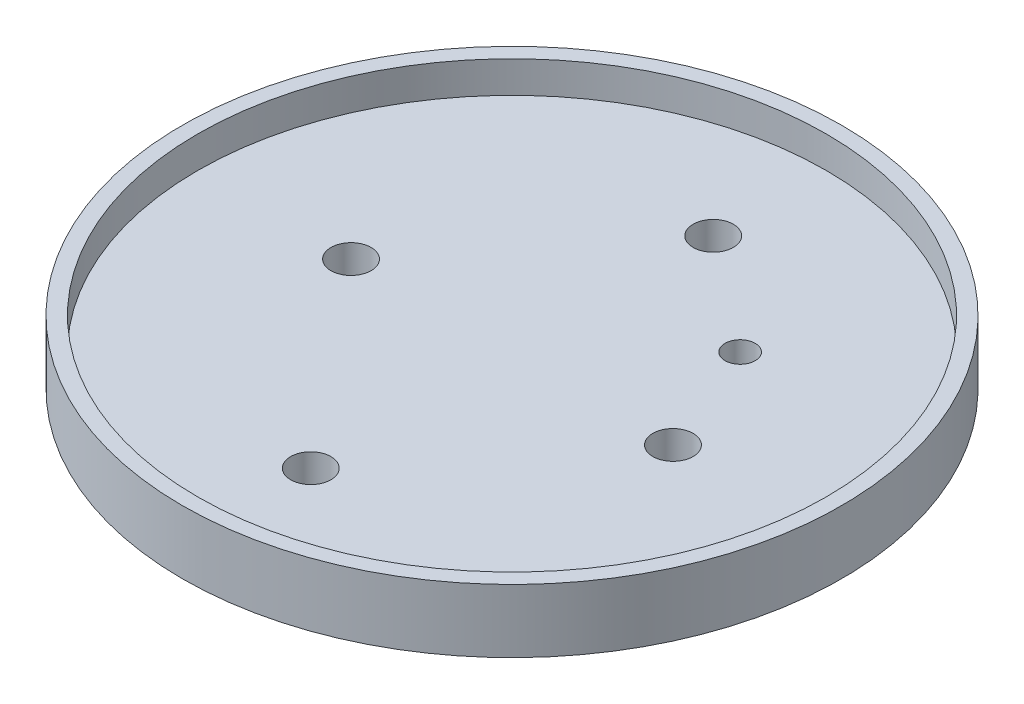
ISO-10303-21;
HEADER;
FILE_DESCRIPTION(('STEP AP214'),'2;1');
FILE_NAME('part.step','',(''),(''),'','','');
FILE_SCHEMA(('AUTOMOTIVE_DESIGN { 1 0 10303 214 1 1 1 1 }'));
ENDSEC;
DATA;
#1=APPLICATION_CONTEXT('core data for automotive mechanical design processes');
#2=APPLICATION_PROTOCOL_DEFINITION('international standard','automotive_design',2000,#1);
#3=PRODUCT_CONTEXT('',#1,'mechanical');
#4=PRODUCT('Part','Part','',(#3));
#5=PRODUCT_RELATED_PRODUCT_CATEGORY('part','',(#4));
#6=PRODUCT_DEFINITION_FORMATION('','',#4);
#7=PRODUCT_DEFINITION_CONTEXT('part definition',#1,'design');
#8=PRODUCT_DEFINITION('design','',#6,#7);
#9=PRODUCT_DEFINITION_SHAPE('','',#8);
#10=(LENGTH_UNIT() NAMED_UNIT(*) SI_UNIT(.MILLI.,.METRE.));
#11=(NAMED_UNIT(*) PLANE_ANGLE_UNIT() SI_UNIT($,.RADIAN.));
#12=(NAMED_UNIT(*) SI_UNIT($,.STERADIAN.) SOLID_ANGLE_UNIT());
#13=UNCERTAINTY_MEASURE_WITH_UNIT(LENGTH_MEASURE(1.E-05),#10,'distance_accuracy_value','');
#14=(GEOMETRIC_REPRESENTATION_CONTEXT(3) GLOBAL_UNCERTAINTY_ASSIGNED_CONTEXT((#13)) GLOBAL_UNIT_ASSIGNED_CONTEXT((#10,
#11,#12)) REPRESENTATION_CONTEXT('',''));
#15=CARTESIAN_POINT('',(0.,0.,0.));
#16=DIRECTION('',(0.,0.,1.));
#17=DIRECTION('',(1.,0.,0.));
#18=AXIS2_PLACEMENT_3D('',#15,#16,#17);
#19=CARTESIAN_POINT('',(0.,5.,0.));
#20=DIRECTION('',(0.,1.,0.));
#21=DIRECTION('',(0.,0.,1.));
#22=AXIS2_PLACEMENT_3D('',#19,#20,#21);
#23=PLANE('',#22);
#24=CARTESIAN_POINT('',(18.,5.,-18.));
#25=DIRECTION('',(0.,1.,0.));
#26=DIRECTION('',(0.,0.,1.));
#27=AXIS2_PLACEMENT_3D('',#24,#25,#26);
#28=CIRCLE('',#27,2.38);
#29=CARTESIAN_POINT('',(18.,5.,-15.62));
#30=VERTEX_POINT('',#29);
#31=EDGE_CURVE('E68',#30,#30,#28,.T.);
#32=ORIENTED_EDGE('',*,*,#31,.F.);
#33=EDGE_LOOP('',(#32));
#34=FACE_BOUND('',#33,.T.);
#35=CARTESIAN_POINT('',(-25.4,5.,0.));
#36=DIRECTION('',(0.,1.,0.));
#37=DIRECTION('',(0.,0.,1.));
#38=AXIS2_PLACEMENT_3D('',#35,#36,#37);
#39=CIRCLE('',#38,3.175);
#40=CARTESIAN_POINT('',(-25.4,5.,3.175));
#41=VERTEX_POINT('',#40);
#42=EDGE_CURVE('E56',#41,#41,#39,.T.);
#43=ORIENTED_EDGE('',*,*,#42,.F.);
#44=EDGE_LOOP('',(#43));
#45=FACE_BOUND('',#44,.T.);
#46=CARTESIAN_POINT('',(25.4,5.,0.));
#47=DIRECTION('',(0.,1.,0.));
#48=DIRECTION('',(0.,0.,1.));
#49=AXIS2_PLACEMENT_3D('',#46,#47,#48);
#50=CIRCLE('',#49,3.175);
#51=CARTESIAN_POINT('',(25.4,5.,3.175));
#52=VERTEX_POINT('',#51);
#53=EDGE_CURVE('E43',#52,#52,#50,.T.);
#54=ORIENTED_EDGE('',*,*,#53,.F.);
#55=EDGE_LOOP('',(#54));
#56=FACE_BOUND('',#55,.T.);
#57=CARTESIAN_POINT('',(0.,5.,-31.75));
#58=DIRECTION('',(0.,1.,0.));
#59=DIRECTION('',(0.,0.,1.));
#60=AXIS2_PLACEMENT_3D('',#57,#58,#59);
#61=CIRCLE('',#60,3.175);
#62=CARTESIAN_POINT('',(0.,5.,-28.575));
#63=VERTEX_POINT('',#62);
#64=EDGE_CURVE('E51',#63,#63,#61,.T.);
#65=ORIENTED_EDGE('',*,*,#64,.F.);
#66=EDGE_LOOP('',(#65));
#67=FACE_BOUND('',#66,.T.);
#68=CARTESIAN_POINT('',(0.,5.,31.75));
#69=DIRECTION('',(0.,1.,0.));
#70=DIRECTION('',(0.,0.,1.));
#71=AXIS2_PLACEMENT_3D('',#68,#69,#70);
#72=CIRCLE('',#71,3.175);
#73=CARTESIAN_POINT('',(0.,5.,34.925));
#74=VERTEX_POINT('',#73);
#75=EDGE_CURVE('E62',#74,#74,#72,.T.);
#76=ORIENTED_EDGE('',*,*,#75,.F.);
#77=EDGE_LOOP('',(#76));
#78=FACE_BOUND('',#77,.T.);
#79=CARTESIAN_POINT('',(0.,5.,0.));
#80=DIRECTION('',(0.,1.,0.));
#81=DIRECTION('',(0.,0.,1.));
#82=AXIS2_PLACEMENT_3D('',#79,#80,#81);
#83=CIRCLE('',#82,49.6);
#84=CARTESIAN_POINT('',(0.,5.,49.6));
#85=VERTEX_POINT('',#84);
#86=EDGE_CURVE('E10',#85,#85,#83,.F.);
#87=ORIENTED_EDGE('',*,*,#86,.F.);
#88=EDGE_LOOP('',(#87));
#89=FACE_BOUND('',#88,.T.);
#90=ADVANCED_FACE('F32',(#34,#45,#56,#67,#78,#89),#23,.T.);
#91=CARTESIAN_POINT('',(0.,0.,0.));
#92=DIRECTION('',(0.,1.,0.));
#93=DIRECTION('',(0.,0.,1.));
#94=AXIS2_PLACEMENT_3D('',#91,#92,#93);
#95=PLANE('',#94);
#96=CARTESIAN_POINT('',(0.,0.,0.));
#97=DIRECTION('',(0.,1.,0.));
#98=DIRECTION('',(0.,0.,1.));
#99=AXIS2_PLACEMENT_3D('',#96,#97,#98);
#100=CIRCLE('',#99,52.);
#101=CARTESIAN_POINT('',(0.,0.,52.));
#102=VERTEX_POINT('',#101);
#103=EDGE_CURVE('E39',#102,#102,#100,.T.);
#104=ORIENTED_EDGE('',*,*,#103,.F.);
#105=EDGE_LOOP('',(#104));
#106=FACE_BOUND('',#105,.T.);
#107=CARTESIAN_POINT('',(25.4,0.,0.));
#108=DIRECTION('',(0.,1.,0.));
#109=DIRECTION('',(0.,0.,1.));
#110=AXIS2_PLACEMENT_3D('',#107,#108,#109);
#111=CIRCLE('',#110,3.175);
#112=CARTESIAN_POINT('',(25.4,0.,3.175));
#113=VERTEX_POINT('',#112);
#114=EDGE_CURVE('E47',#113,#113,#111,.T.);
#115=ORIENTED_EDGE('',*,*,#114,.T.);
#116=EDGE_LOOP('',(#115));
#117=FACE_BOUND('',#116,.T.);
#118=CARTESIAN_POINT('',(0.,0.,-31.75));
#119=DIRECTION('',(0.,1.,0.));
#120=DIRECTION('',(0.,0.,1.));
#121=AXIS2_PLACEMENT_3D('',#118,#119,#120);
#122=CIRCLE('',#121,3.175);
#123=CARTESIAN_POINT('',(0.,0.,-28.575));
#124=VERTEX_POINT('',#123);
#125=EDGE_CURVE('E53',#124,#124,#122,.T.);
#126=ORIENTED_EDGE('',*,*,#125,.T.);
#127=EDGE_LOOP('',(#126));
#128=FACE_BOUND('',#127,.T.);
#129=CARTESIAN_POINT('',(-25.4,0.,0.));
#130=DIRECTION('',(0.,1.,0.));
#131=DIRECTION('',(0.,0.,1.));
#132=AXIS2_PLACEMENT_3D('',#129,#130,#131);
#133=CIRCLE('',#132,3.175);
#134=CARTESIAN_POINT('',(-25.4,0.,3.175));
#135=VERTEX_POINT('',#134);
#136=EDGE_CURVE('E59',#135,#135,#133,.T.);
#137=ORIENTED_EDGE('',*,*,#136,.T.);
#138=EDGE_LOOP('',(#137));
#139=FACE_BOUND('',#138,.T.);
#140=CARTESIAN_POINT('',(0.,0.,31.75));
#141=DIRECTION('',(0.,1.,0.));
#142=DIRECTION('',(0.,0.,1.));
#143=AXIS2_PLACEMENT_3D('',#140,#141,#142);
#144=CIRCLE('',#143,3.175);
#145=CARTESIAN_POINT('',(0.,0.,34.925));
#146=VERTEX_POINT('',#145);
#147=EDGE_CURVE('E65',#146,#146,#144,.T.);
#148=ORIENTED_EDGE('',*,*,#147,.T.);
#149=EDGE_LOOP('',(#148));
#150=FACE_BOUND('',#149,.T.);
#151=CARTESIAN_POINT('',(18.,0.,-18.));
#152=DIRECTION('',(0.,1.,0.));
#153=DIRECTION('',(0.,0.,1.));
#154=AXIS2_PLACEMENT_3D('',#151,#152,#153);
#155=CIRCLE('',#154,2.38);
#156=CARTESIAN_POINT('',(18.,0.,-15.62));
#157=VERTEX_POINT('',#156);
#158=EDGE_CURVE('E71',#157,#157,#155,.T.);
#159=ORIENTED_EDGE('',*,*,#158,.T.);
#160=EDGE_LOOP('',(#159));
#161=FACE_BOUND('',#160,.T.);
#162=ADVANCED_FACE('F99',(#106,#117,#128,#139,#150,#161),#95,.F.);
#163=CARTESIAN_POINT('',(0.,5.,0.));
#164=DIRECTION('',(0.,-1.,0.));
#165=DIRECTION('',(0.,0.,-1.));
#166=AXIS2_PLACEMENT_3D('',#163,#164,#165);
#167=CYLINDRICAL_SURFACE('',#166,52.);
#168=ORIENTED_EDGE('',*,*,#103,.T.);
#169=EDGE_LOOP('',(#168));
#170=FACE_BOUND('',#169,.T.);
#171=CARTESIAN_POINT('',(0.,10.,0.));
#172=DIRECTION('',(0.,1.,0.));
#173=DIRECTION('',(0.,0.,1.));
#174=AXIS2_PLACEMENT_3D('',#171,#172,#173);
#175=CIRCLE('',#174,52.);
#176=CARTESIAN_POINT('',(0.,10.,52.));
#177=VERTEX_POINT('',#176);
#178=EDGE_CURVE('E74',#177,#177,#175,.T.);
#179=ORIENTED_EDGE('',*,*,#178,.F.);
#180=EDGE_LOOP('',(#179));
#181=FACE_BOUND('',#180,.T.);
#182=ADVANCED_FACE('F34',(#170,#181),#167,.T.);
#183=CARTESIAN_POINT('',(25.4,5.,0.));
#184=DIRECTION('',(0.,-1.,0.));
#185=DIRECTION('',(0.,0.,-1.));
#186=AXIS2_PLACEMENT_3D('',#183,#184,#185);
#187=CYLINDRICAL_SURFACE('',#186,3.175);
#188=ORIENTED_EDGE('',*,*,#53,.T.);
#189=EDGE_LOOP('',(#188));
#190=FACE_BOUND('',#189,.T.);
#191=ORIENTED_EDGE('',*,*,#114,.F.);
#192=EDGE_LOOP('',(#191));
#193=FACE_BOUND('',#192,.T.);
#194=ADVANCED_FACE('F109',(#190,#193),#187,.F.);
#195=CARTESIAN_POINT('',(0.,5.,-31.75));
#196=DIRECTION('',(0.,-1.,0.));
#197=DIRECTION('',(0.,0.,-1.));
#198=AXIS2_PLACEMENT_3D('',#195,#196,#197);
#199=CYLINDRICAL_SURFACE('',#198,3.175);
#200=ORIENTED_EDGE('',*,*,#64,.T.);
#201=EDGE_LOOP('',(#200));
#202=FACE_BOUND('',#201,.T.);
#203=ORIENTED_EDGE('',*,*,#125,.F.);
#204=EDGE_LOOP('',(#203));
#205=FACE_BOUND('',#204,.T.);
#206=ADVANCED_FACE('F112',(#202,#205),#199,.F.);
#207=CARTESIAN_POINT('',(-25.4,5.,0.));
#208=DIRECTION('',(0.,-1.,0.));
#209=DIRECTION('',(0.,0.,-1.));
#210=AXIS2_PLACEMENT_3D('',#207,#208,#209);
#211=CYLINDRICAL_SURFACE('',#210,3.175);
#212=ORIENTED_EDGE('',*,*,#42,.T.);
#213=EDGE_LOOP('',(#212));
#214=FACE_BOUND('',#213,.T.);
#215=ORIENTED_EDGE('',*,*,#136,.F.);
#216=EDGE_LOOP('',(#215));
#217=FACE_BOUND('',#216,.T.);
#218=ADVANCED_FACE('F116',(#214,#217),#211,.F.);
#219=CARTESIAN_POINT('',(0.,5.,31.75));
#220=DIRECTION('',(0.,-1.,0.));
#221=DIRECTION('',(0.,0.,-1.));
#222=AXIS2_PLACEMENT_3D('',#219,#220,#221);
#223=CYLINDRICAL_SURFACE('',#222,3.175);
#224=ORIENTED_EDGE('',*,*,#75,.T.);
#225=EDGE_LOOP('',(#224));
#226=FACE_BOUND('',#225,.T.);
#227=ORIENTED_EDGE('',*,*,#147,.F.);
#228=EDGE_LOOP('',(#227));
#229=FACE_BOUND('',#228,.T.);
#230=ADVANCED_FACE('F95',(#226,#229),#223,.F.);
#231=CARTESIAN_POINT('',(18.,5.,-18.));
#232=DIRECTION('',(0.,-1.,0.));
#233=DIRECTION('',(0.,0.,-1.));
#234=AXIS2_PLACEMENT_3D('',#231,#232,#233);
#235=CYLINDRICAL_SURFACE('',#234,2.38);
#236=ORIENTED_EDGE('',*,*,#31,.T.);
#237=EDGE_LOOP('',(#236));
#238=FACE_BOUND('',#237,.T.);
#239=ORIENTED_EDGE('',*,*,#158,.F.);
#240=EDGE_LOOP('',(#239));
#241=FACE_BOUND('',#240,.T.);
#242=ADVANCED_FACE('F87',(#238,#241),#235,.F.);
#243=CARTESIAN_POINT('',(0.,10.,0.));
#244=DIRECTION('',(0.,1.,0.));
#245=DIRECTION('',(0.,0.,1.));
#246=AXIS2_PLACEMENT_3D('',#243,#244,#245);
#247=PLANE('',#246);
#248=ORIENTED_EDGE('',*,*,#178,.T.);
#249=EDGE_LOOP('',(#248));
#250=FACE_BOUND('',#249,.T.);
#251=CARTESIAN_POINT('',(0.,10.,0.));
#252=DIRECTION('',(0.,1.,0.));
#253=DIRECTION('',(0.,0.,1.));
#254=AXIS2_PLACEMENT_3D('',#251,#252,#253);
#255=CIRCLE('',#254,49.6);
#256=CARTESIAN_POINT('',(0.,10.,49.6));
#257=VERTEX_POINT('',#256);
#258=EDGE_CURVE('E79',#257,#257,#255,.T.);
#259=ORIENTED_EDGE('',*,*,#258,.F.);
#260=EDGE_LOOP('',(#259));
#261=FACE_BOUND('',#260,.T.);
#262=ADVANCED_FACE('F85',(#250,#261),#247,.T.);
#263=CARTESIAN_POINT('',(0.,10.,0.));
#264=DIRECTION('',(0.,-1.,0.));
#265=DIRECTION('',(0.,0.,-1.));
#266=AXIS2_PLACEMENT_3D('',#263,#264,#265);
#267=CYLINDRICAL_SURFACE('',#266,49.6);
#268=ORIENTED_EDGE('',*,*,#258,.T.);
#269=EDGE_LOOP('',(#268));
#270=FACE_BOUND('',#269,.T.);
#271=ORIENTED_EDGE('',*,*,#86,.T.);
#272=EDGE_LOOP('',(#271));
#273=FACE_BOUND('',#272,.T.);
#274=ADVANCED_FACE('F83',(#270,#273),#267,.F.);
#275=CLOSED_SHELL('',(#90,#162,#182,#194,#206,#218,#230,#242,#262,#274));
#276=MANIFOLD_SOLID_BREP('B2',#275);
#277=ADVANCED_BREP_SHAPE_REPRESENTATION('',(#18,#276),#14);
#278=SHAPE_DEFINITION_REPRESENTATION(#9,#277);
ENDSEC;
END-ISO-10303-21;
